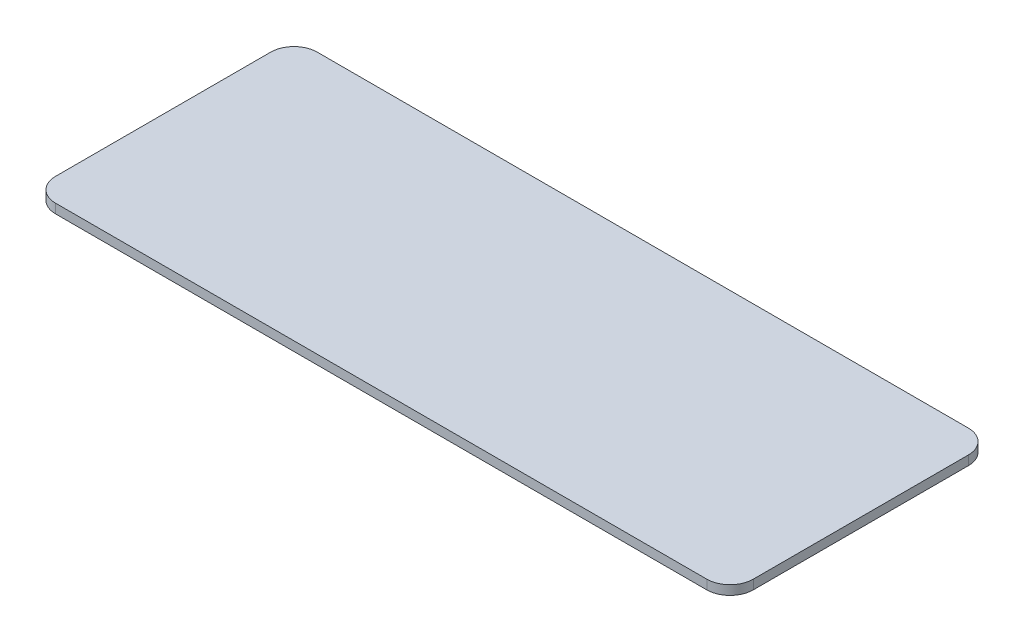
ISO-10303-21;
HEADER;
FILE_DESCRIPTION(('STEP AP214'),'2;1');
FILE_NAME('part.step','',(''),(''),'','','');
FILE_SCHEMA(('AUTOMOTIVE_DESIGN { 1 0 10303 214 1 1 1 1 }'));
ENDSEC;
DATA;
#1=APPLICATION_CONTEXT('core data for automotive mechanical design processes');
#2=APPLICATION_PROTOCOL_DEFINITION('international standard','automotive_design',2000,#1);
#3=PRODUCT_CONTEXT('',#1,'mechanical');
#4=PRODUCT('Part','Part','',(#3));
#5=PRODUCT_RELATED_PRODUCT_CATEGORY('part','',(#4));
#6=PRODUCT_DEFINITION_FORMATION('','',#4);
#7=PRODUCT_DEFINITION_CONTEXT('part definition',#1,'design');
#8=PRODUCT_DEFINITION('design','',#6,#7);
#9=PRODUCT_DEFINITION_SHAPE('','',#8);
#10=(LENGTH_UNIT() NAMED_UNIT(*) SI_UNIT(.MILLI.,.METRE.));
#11=(NAMED_UNIT(*) PLANE_ANGLE_UNIT() SI_UNIT($,.RADIAN.));
#12=(NAMED_UNIT(*) SI_UNIT($,.STERADIAN.) SOLID_ANGLE_UNIT());
#13=UNCERTAINTY_MEASURE_WITH_UNIT(LENGTH_MEASURE(1.E-05),#10,'distance_accuracy_value','');
#14=(GEOMETRIC_REPRESENTATION_CONTEXT(3) GLOBAL_UNCERTAINTY_ASSIGNED_CONTEXT((#13)) GLOBAL_UNIT_ASSIGNED_CONTEXT((#10,
#11,#12)) REPRESENTATION_CONTEXT('',''));
#15=CARTESIAN_POINT('',(0.,0.,0.));
#16=DIRECTION('',(0.,0.,1.));
#17=DIRECTION('',(1.,0.,0.));
#18=AXIS2_PLACEMENT_3D('',#15,#16,#17);
#19=CARTESIAN_POINT('',(60.,1.6,22.5));
#20=DIRECTION('',(-1.,0.,0.));
#21=DIRECTION('',(0.,0.,1.));
#22=AXIS2_PLACEMENT_3D('',#19,#20,#21);
#23=PLANE('',#22);
#24=DIRECTION('',(0.,0.,-1.));
#25=VECTOR('',#24,1.);
#26=CARTESIAN_POINT('',(60.,1.6,22.5));
#27=LINE('',#26,#25);
#28=CARTESIAN_POINT('',(60.,1.6,18.5));
#29=VERTEX_POINT('',#28);
#30=CARTESIAN_POINT('',(60.,1.6,-18.5));
#31=VERTEX_POINT('',#30);
#32=EDGE_CURVE('E124',#29,#31,#27,.T.);
#33=ORIENTED_EDGE('',*,*,#32,.F.);
#34=DIRECTION('',(0.,-1.,0.));
#35=VECTOR('',#34,1.);
#36=CARTESIAN_POINT('',(60.,1.6,18.5));
#37=LINE('',#36,#35);
#38=CARTESIAN_POINT('',(60.,0.,18.5));
#39=VERTEX_POINT('',#38);
#40=EDGE_CURVE('E109',#29,#39,#37,.T.);
#41=ORIENTED_EDGE('',*,*,#40,.T.);
#42=DIRECTION('',(0.,0.,-1.));
#43=VECTOR('',#42,1.);
#44=CARTESIAN_POINT('',(60.,0.,22.5));
#45=LINE('',#44,#43);
#46=CARTESIAN_POINT('',(60.,0.,-18.5));
#47=VERTEX_POINT('',#46);
#48=EDGE_CURVE('E121',#39,#47,#45,.T.);
#49=ORIENTED_EDGE('',*,*,#48,.T.);
#50=DIRECTION('',(0.,-1.,0.));
#51=VECTOR('',#50,1.);
#52=CARTESIAN_POINT('',(60.,1.6,-18.5));
#53=LINE('',#52,#51);
#54=EDGE_CURVE('E126',#47,#31,#53,.F.);
#55=ORIENTED_EDGE('',*,*,#54,.T.);
#56=EDGE_LOOP('',(#33,#41,#49,#55));
#57=FACE_BOUND('',#56,.T.);
#58=ADVANCED_FACE('F39',(#57),#23,.F.);
#59=CARTESIAN_POINT('',(-60.,1.6,-22.5));
#60=DIRECTION('',(0.,0.,1.));
#61=DIRECTION('',(1.,0.,0.));
#62=AXIS2_PLACEMENT_3D('',#59,#60,#61);
#63=PLANE('',#62);
#64=DIRECTION('',(-1.,0.,0.));
#65=VECTOR('',#64,1.);
#66=CARTESIAN_POINT('',(-60.,1.6,-22.5));
#67=LINE('',#66,#65);
#68=CARTESIAN_POINT('',(56.,1.6,-22.5));
#69=VERTEX_POINT('',#68);
#70=CARTESIAN_POINT('',(-56.,1.6,-22.5));
#71=VERTEX_POINT('',#70);
#72=EDGE_CURVE('E166',#69,#71,#67,.T.);
#73=ORIENTED_EDGE('',*,*,#72,.F.);
#74=DIRECTION('',(0.,-1.,0.));
#75=VECTOR('',#74,1.);
#76=CARTESIAN_POINT('',(56.,1.6,-22.5));
#77=LINE('',#76,#75);
#78=CARTESIAN_POINT('',(56.,0.,-22.5));
#79=VERTEX_POINT('',#78);
#80=EDGE_CURVE('E159',#69,#79,#77,.T.);
#81=ORIENTED_EDGE('',*,*,#80,.T.);
#82=DIRECTION('',(-1.,0.,0.));
#83=VECTOR('',#82,1.);
#84=CARTESIAN_POINT('',(-60.,0.,-22.5));
#85=LINE('',#84,#83);
#86=CARTESIAN_POINT('',(-56.,0.,-22.5));
#87=VERTEX_POINT('',#86);
#88=EDGE_CURVE('E130',#79,#87,#85,.T.);
#89=ORIENTED_EDGE('',*,*,#88,.T.);
#90=DIRECTION('',(0.,-1.,0.));
#91=VECTOR('',#90,1.);
#92=CARTESIAN_POINT('',(-56.,1.6,-22.5));
#93=LINE('',#92,#91);
#94=EDGE_CURVE('E157',#87,#71,#93,.F.);
#95=ORIENTED_EDGE('',*,*,#94,.T.);
#96=EDGE_LOOP('',(#73,#81,#89,#95));
#97=FACE_BOUND('',#96,.T.);
#98=ADVANCED_FACE('F164',(#97),#63,.F.);
#99=CARTESIAN_POINT('',(-60.,1.6,22.5));
#100=DIRECTION('',(1.,0.,0.));
#101=DIRECTION('',(0.,0.,-1.));
#102=AXIS2_PLACEMENT_3D('',#99,#100,#101);
#103=PLANE('',#102);
#104=DIRECTION('',(0.,0.,1.));
#105=VECTOR('',#104,1.);
#106=CARTESIAN_POINT('',(-60.,1.6,22.5));
#107=LINE('',#106,#105);
#108=CARTESIAN_POINT('',(-60.,1.6,-18.5));
#109=VERTEX_POINT('',#108);
#110=CARTESIAN_POINT('',(-60.,1.6,18.5));
#111=VERTEX_POINT('',#110);
#112=EDGE_CURVE('E174',#109,#111,#107,.T.);
#113=ORIENTED_EDGE('',*,*,#112,.F.);
#114=DIRECTION('',(0.,-1.,0.));
#115=VECTOR('',#114,1.);
#116=CARTESIAN_POINT('',(-60.,1.6,-18.5));
#117=LINE('',#116,#115);
#118=CARTESIAN_POINT('',(-60.,0.,-18.5));
#119=VERTEX_POINT('',#118);
#120=EDGE_CURVE('E11',#109,#119,#117,.T.);
#121=ORIENTED_EDGE('',*,*,#120,.T.);
#122=DIRECTION('',(0.,0.,1.));
#123=VECTOR('',#122,1.);
#124=CARTESIAN_POINT('',(-60.,0.,22.5));
#125=LINE('',#124,#123);
#126=CARTESIAN_POINT('',(-60.,0.,18.5));
#127=VERTEX_POINT('',#126);
#128=EDGE_CURVE('E133',#119,#127,#125,.T.);
#129=ORIENTED_EDGE('',*,*,#128,.T.);
#130=DIRECTION('',(0.,-1.,0.));
#131=VECTOR('',#130,1.);
#132=CARTESIAN_POINT('',(-60.,1.6,18.5));
#133=LINE('',#132,#131);
#134=EDGE_CURVE('E47',#127,#111,#133,.F.);
#135=ORIENTED_EDGE('',*,*,#134,.T.);
#136=EDGE_LOOP('',(#113,#121,#129,#135));
#137=FACE_BOUND('',#136,.T.);
#138=ADVANCED_FACE('F173',(#137),#103,.F.);
#139=CARTESIAN_POINT('',(-60.,1.6,22.5));
#140=DIRECTION('',(0.,0.,-1.));
#141=DIRECTION('',(-1.,0.,0.));
#142=AXIS2_PLACEMENT_3D('',#139,#140,#141);
#143=PLANE('',#142);
#144=DIRECTION('',(1.,0.,0.));
#145=VECTOR('',#144,1.);
#146=CARTESIAN_POINT('',(-60.,0.,22.5));
#147=LINE('',#146,#145);
#148=CARTESIAN_POINT('',(-56.,0.,22.5));
#149=VERTEX_POINT('',#148);
#150=CARTESIAN_POINT('',(56.,0.,22.5));
#151=VERTEX_POINT('',#150);
#152=EDGE_CURVE('E140',#149,#151,#147,.T.);
#153=ORIENTED_EDGE('',*,*,#152,.T.);
#154=DIRECTION('',(0.,-1.,0.));
#155=VECTOR('',#154,1.);
#156=CARTESIAN_POINT('',(56.,1.6,22.5));
#157=LINE('',#156,#155);
#158=CARTESIAN_POINT('',(56.,1.6,22.5));
#159=VERTEX_POINT('',#158);
#160=EDGE_CURVE('E110',#151,#159,#157,.F.);
#161=ORIENTED_EDGE('',*,*,#160,.T.);
#162=DIRECTION('',(1.,0.,0.));
#163=VECTOR('',#162,1.);
#164=CARTESIAN_POINT('',(-60.,1.6,22.5));
#165=LINE('',#164,#163);
#166=CARTESIAN_POINT('',(-56.,1.6,22.5));
#167=VERTEX_POINT('',#166);
#168=EDGE_CURVE('E136',#167,#159,#165,.T.);
#169=ORIENTED_EDGE('',*,*,#168,.F.);
#170=DIRECTION('',(0.,-1.,0.));
#171=VECTOR('',#170,1.);
#172=CARTESIAN_POINT('',(-56.,1.6,22.5));
#173=LINE('',#172,#171);
#174=EDGE_CURVE('E115',#167,#149,#173,.T.);
#175=ORIENTED_EDGE('',*,*,#174,.T.);
#176=EDGE_LOOP('',(#153,#161,#169,#175));
#177=FACE_BOUND('',#176,.T.);
#178=ADVANCED_FACE('F197',(#177),#143,.F.);
#179=CARTESIAN_POINT('',(0.,1.6,0.));
#180=DIRECTION('',(0.,-1.,0.));
#181=DIRECTION('',(0.,0.,-1.));
#182=AXIS2_PLACEMENT_3D('',#179,#180,#181);
#183=PLANE('',#182);
#184=ORIENTED_EDGE('',*,*,#168,.T.);
#185=CARTESIAN_POINT('',(56.,1.6,18.5));
#186=DIRECTION('',(0.,-1.,0.));
#187=DIRECTION('',(0.,0.,-1.));
#188=AXIS2_PLACEMENT_3D('',#185,#186,#187);
#189=CIRCLE('',#188,4.);
#190=EDGE_CURVE('E155',#159,#29,#189,.F.);
#191=ORIENTED_EDGE('',*,*,#190,.T.);
#192=ORIENTED_EDGE('',*,*,#32,.T.);
#193=CARTESIAN_POINT('',(56.,1.6,-18.5));
#194=DIRECTION('',(0.,-1.,0.));
#195=DIRECTION('',(0.,0.,-1.));
#196=AXIS2_PLACEMENT_3D('',#193,#194,#195);
#197=CIRCLE('',#196,4.);
#198=EDGE_CURVE('E153',#31,#69,#197,.F.);
#199=ORIENTED_EDGE('',*,*,#198,.T.);
#200=ORIENTED_EDGE('',*,*,#72,.T.);
#201=CARTESIAN_POINT('',(-56.,1.6,-18.5));
#202=DIRECTION('',(0.,-1.,0.));
#203=DIRECTION('',(0.,0.,-1.));
#204=AXIS2_PLACEMENT_3D('',#201,#202,#203);
#205=CIRCLE('',#204,4.);
#206=EDGE_CURVE('E60',#71,#109,#205,.F.);
#207=ORIENTED_EDGE('',*,*,#206,.T.);
#208=ORIENTED_EDGE('',*,*,#112,.T.);
#209=CARTESIAN_POINT('',(-56.,1.6,18.5));
#210=DIRECTION('',(0.,-1.,0.));
#211=DIRECTION('',(0.,0.,-1.));
#212=AXIS2_PLACEMENT_3D('',#209,#210,#211);
#213=CIRCLE('',#212,4.);
#214=EDGE_CURVE('E150',#111,#167,#213,.F.);
#215=ORIENTED_EDGE('',*,*,#214,.T.);
#216=EDGE_LOOP('',(#184,#191,#192,#199,#200,#207,#208,#215));
#217=FACE_BOUND('',#216,.T.);
#218=ADVANCED_FACE('F179',(#217),#183,.F.);
#219=CARTESIAN_POINT('',(0.,0.,0.));
#220=DIRECTION('',(0.,-1.,0.));
#221=DIRECTION('',(0.,0.,-1.));
#222=AXIS2_PLACEMENT_3D('',#219,#220,#221);
#223=PLANE('',#222);
#224=ORIENTED_EDGE('',*,*,#48,.F.);
#225=CARTESIAN_POINT('',(56.,0.,18.5));
#226=DIRECTION('',(0.,-1.,0.));
#227=DIRECTION('',(0.,0.,-1.));
#228=AXIS2_PLACEMENT_3D('',#225,#226,#227);
#229=CIRCLE('',#228,4.);
#230=EDGE_CURVE('E105',#39,#151,#229,.T.);
#231=ORIENTED_EDGE('',*,*,#230,.T.);
#232=ORIENTED_EDGE('',*,*,#152,.F.);
#233=CARTESIAN_POINT('',(-56.,0.,18.5));
#234=DIRECTION('',(0.,-1.,0.));
#235=DIRECTION('',(0.,0.,-1.));
#236=AXIS2_PLACEMENT_3D('',#233,#234,#235);
#237=CIRCLE('',#236,4.);
#238=EDGE_CURVE('E125',#149,#127,#237,.T.);
#239=ORIENTED_EDGE('',*,*,#238,.T.);
#240=ORIENTED_EDGE('',*,*,#128,.F.);
#241=CARTESIAN_POINT('',(-56.,0.,-18.5));
#242=DIRECTION('',(0.,-1.,0.));
#243=DIRECTION('',(0.,0.,-1.));
#244=AXIS2_PLACEMENT_3D('',#241,#242,#243);
#245=CIRCLE('',#244,4.);
#246=EDGE_CURVE('E144',#119,#87,#245,.T.);
#247=ORIENTED_EDGE('',*,*,#246,.T.);
#248=ORIENTED_EDGE('',*,*,#88,.F.);
#249=CARTESIAN_POINT('',(56.,0.,-18.5));
#250=DIRECTION('',(0.,-1.,0.));
#251=DIRECTION('',(0.,0.,-1.));
#252=AXIS2_PLACEMENT_3D('',#249,#250,#251);
#253=CIRCLE('',#252,4.);
#254=EDGE_CURVE('E116',#79,#47,#253,.T.);
#255=ORIENTED_EDGE('',*,*,#254,.T.);
#256=EDGE_LOOP('',(#224,#231,#232,#239,#240,#247,#248,#255));
#257=FACE_BOUND('',#256,.T.);
#258=ADVANCED_FACE('F128',(#257),#223,.T.);
#259=CARTESIAN_POINT('',(56.,1.6,18.5));
#260=DIRECTION('',(0.,-1.,0.));
#261=DIRECTION('',(0.,0.,-1.));
#262=AXIS2_PLACEMENT_3D('',#259,#260,#261);
#263=CYLINDRICAL_SURFACE('',#262,4.);
#264=ORIENTED_EDGE('',*,*,#190,.F.);
#265=ORIENTED_EDGE('',*,*,#160,.F.);
#266=ORIENTED_EDGE('',*,*,#230,.F.);
#267=ORIENTED_EDGE('',*,*,#40,.F.);
#268=EDGE_LOOP('',(#264,#265,#266,#267));
#269=FACE_BOUND('',#268,.T.);
#270=ADVANCED_FACE('F108',(#269),#263,.T.);
#271=CARTESIAN_POINT('',(56.,1.6,-18.5));
#272=DIRECTION('',(0.,-1.,0.));
#273=DIRECTION('',(0.,0.,-1.));
#274=AXIS2_PLACEMENT_3D('',#271,#272,#273);
#275=CYLINDRICAL_SURFACE('',#274,4.);
#276=ORIENTED_EDGE('',*,*,#198,.F.);
#277=ORIENTED_EDGE('',*,*,#54,.F.);
#278=ORIENTED_EDGE('',*,*,#254,.F.);
#279=ORIENTED_EDGE('',*,*,#80,.F.);
#280=EDGE_LOOP('',(#276,#277,#278,#279));
#281=FACE_BOUND('',#280,.T.);
#282=ADVANCED_FACE('F180',(#281),#275,.T.);
#283=CARTESIAN_POINT('',(-56.,1.6,-18.5));
#284=DIRECTION('',(0.,-1.,0.));
#285=DIRECTION('',(0.,0.,-1.));
#286=AXIS2_PLACEMENT_3D('',#283,#284,#285);
#287=CYLINDRICAL_SURFACE('',#286,4.);
#288=ORIENTED_EDGE('',*,*,#206,.F.);
#289=ORIENTED_EDGE('',*,*,#94,.F.);
#290=ORIENTED_EDGE('',*,*,#246,.F.);
#291=ORIENTED_EDGE('',*,*,#120,.F.);
#292=EDGE_LOOP('',(#288,#289,#290,#291));
#293=FACE_BOUND('',#292,.T.);
#294=ADVANCED_FACE('F172',(#293),#287,.T.);
#295=CARTESIAN_POINT('',(-56.,1.6,18.5));
#296=DIRECTION('',(0.,-1.,0.));
#297=DIRECTION('',(0.,0.,-1.));
#298=AXIS2_PLACEMENT_3D('',#295,#296,#297);
#299=CYLINDRICAL_SURFACE('',#298,4.);
#300=ORIENTED_EDGE('',*,*,#214,.F.);
#301=ORIENTED_EDGE('',*,*,#134,.F.);
#302=ORIENTED_EDGE('',*,*,#238,.F.);
#303=ORIENTED_EDGE('',*,*,#174,.F.);
#304=EDGE_LOOP('',(#300,#301,#302,#303));
#305=FACE_BOUND('',#304,.T.);
#306=ADVANCED_FACE('F41',(#305),#299,.T.);
#307=CLOSED_SHELL('',(#58,#98,#138,#178,#218,#258,#270,#282,#294,#306));
#308=MANIFOLD_SOLID_BREP('B2',#307);
#309=ADVANCED_BREP_SHAPE_REPRESENTATION('',(#18,#308),#14);
#310=SHAPE_DEFINITION_REPRESENTATION(#9,#309);
ENDSEC;
END-ISO-10303-21;
